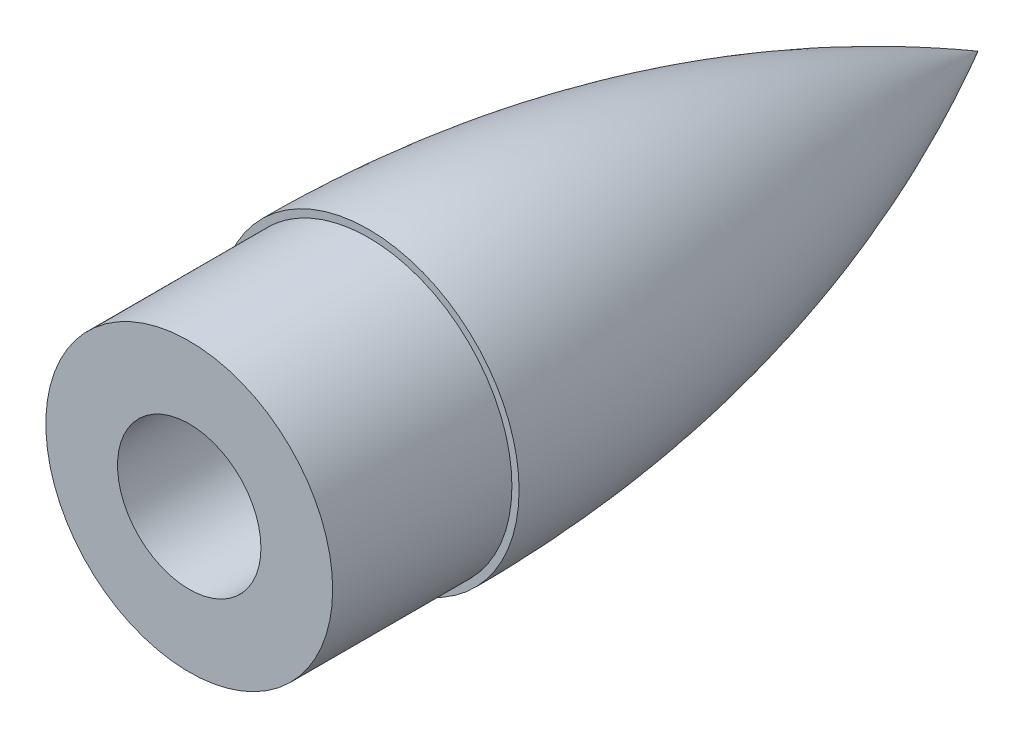
ISO-10303-21;
HEADER;
FILE_DESCRIPTION(('STEP AP214'),'2;1');
FILE_NAME('part.step','',(''),(''),'','','');
FILE_SCHEMA(('AUTOMOTIVE_DESIGN { 1 0 10303 214 1 1 1 1 }'));
ENDSEC;
DATA;
#1=APPLICATION_CONTEXT('core data for automotive mechanical design processes');
#2=APPLICATION_PROTOCOL_DEFINITION('international standard','automotive_design',2000,#1);
#3=PRODUCT_CONTEXT('',#1,'mechanical');
#4=PRODUCT('Part','Part','',(#3));
#5=PRODUCT_RELATED_PRODUCT_CATEGORY('part','',(#4));
#6=PRODUCT_DEFINITION_FORMATION('','',#4);
#7=PRODUCT_DEFINITION_CONTEXT('part definition',#1,'design');
#8=PRODUCT_DEFINITION('design','',#6,#7);
#9=PRODUCT_DEFINITION_SHAPE('','',#8);
#10=(LENGTH_UNIT() NAMED_UNIT(*) SI_UNIT(.MILLI.,.METRE.));
#11=(NAMED_UNIT(*) PLANE_ANGLE_UNIT() SI_UNIT($,.RADIAN.));
#12=(NAMED_UNIT(*) SI_UNIT($,.STERADIAN.) SOLID_ANGLE_UNIT());
#13=UNCERTAINTY_MEASURE_WITH_UNIT(LENGTH_MEASURE(1.E-05),#10,'distance_accuracy_value','');
#14=(GEOMETRIC_REPRESENTATION_CONTEXT(3) GLOBAL_UNCERTAINTY_ASSIGNED_CONTEXT((#13)) GLOBAL_UNIT_ASSIGNED_CONTEXT((#10,
#11,#12)) REPRESENTATION_CONTEXT('',''));
#15=CARTESIAN_POINT('',(0.,0.,0.));
#16=DIRECTION('',(0.,0.,1.));
#17=DIRECTION('',(1.,0.,0.));
#18=AXIS2_PLACEMENT_3D('',#15,#16,#17);
#19=CARTESIAN_POINT('',(0.,0.,50.));
#20=DIRECTION('',(0.,0.,-1.));
#21=DIRECTION('',(-1.,0.,0.));
#22=AXIS2_PLACEMENT_3D('',#19,#20,#21);
#23=CYLINDRICAL_SURFACE('',#22,40.);
#24=CARTESIAN_POINT('',(0.,0.,50.));
#25=DIRECTION('',(0.,0.,1.));
#26=DIRECTION('',(1.,0.,0.));
#27=AXIS2_PLACEMENT_3D('',#24,#25,#26);
#28=CIRCLE('',#27,40.);
#29=CARTESIAN_POINT('',(40.,0.,50.));
#30=VERTEX_POINT('',#29);
#31=EDGE_CURVE('E12',#30,#30,#28,.T.);
#32=ORIENTED_EDGE('',*,*,#31,.F.);
#33=EDGE_LOOP('',(#32));
#34=FACE_BOUND('',#33,.T.);
#35=CARTESIAN_POINT('',(0.,0.,0.));
#36=DIRECTION('',(0.,0.,1.));
#37=DIRECTION('',(1.,0.,0.));
#38=AXIS2_PLACEMENT_3D('',#35,#36,#37);
#39=CIRCLE('',#38,40.);
#40=CARTESIAN_POINT('',(40.,0.,0.));
#41=VERTEX_POINT('',#40);
#42=EDGE_CURVE('E58',#41,#41,#39,.T.);
#43=ORIENTED_EDGE('',*,*,#42,.T.);
#44=EDGE_LOOP('',(#43));
#45=FACE_BOUND('',#44,.T.);
#46=ADVANCED_FACE('F51',(#34,#45),#23,.T.);
#47=CARTESIAN_POINT('',(0.,0.,50.));
#48=DIRECTION('',(0.,0.,1.));
#49=DIRECTION('',(1.,0.,0.));
#50=AXIS2_PLACEMENT_3D('',#47,#48,#49);
#51=PLANE('',#50);
#52=CARTESIAN_POINT('',(0.,0.,50.));
#53=DIRECTION('',(0.,0.,1.));
#54=DIRECTION('',(1.,0.,0.));
#55=AXIS2_PLACEMENT_3D('',#52,#53,#54);
#56=CIRCLE('',#55,20.);
#57=CARTESIAN_POINT('',(20.,0.,50.));
#58=VERTEX_POINT('',#57);
#59=EDGE_CURVE('E64',#58,#58,#56,.T.);
#60=ORIENTED_EDGE('',*,*,#59,.F.);
#61=EDGE_LOOP('',(#60));
#62=FACE_BOUND('',#61,.T.);
#63=ORIENTED_EDGE('',*,*,#31,.T.);
#64=EDGE_LOOP('',(#63));
#65=FACE_BOUND('',#64,.T.);
#66=ADVANCED_FACE('F80',(#62,#65),#51,.T.);
#67=CARTESIAN_POINT('',(0.,0.,0.));
#68=DIRECTION('',(0.,0.,1.));
#69=DIRECTION('',(1.,0.,0.));
#70=AXIS2_PLACEMENT_3D('',#67,#68,#69);
#71=PLANE('',#70);
#72=CARTESIAN_POINT('',(0.,0.,0.));
#73=DIRECTION('',(0.,0.,1.));
#74=DIRECTION('',(1.,0.,0.));
#75=AXIS2_PLACEMENT_3D('',#72,#73,#74);
#76=CIRCLE('',#75,20.);
#77=CARTESIAN_POINT('',(20.,0.,0.));
#78=VERTEX_POINT('',#77);
#79=EDGE_CURVE('E54',#78,#78,#76,.T.);
#80=ORIENTED_EDGE('',*,*,#79,.T.);
#81=EDGE_LOOP('',(#80));
#82=FACE_BOUND('',#81,.T.);
#83=ORIENTED_EDGE('',*,*,#42,.F.);
#84=EDGE_LOOP('',(#83));
#85=FACE_BOUND('',#84,.T.);
#86=ADVANCED_FACE('F71',(#82,#85),#71,.F.);
#87=CARTESIAN_POINT('',(0.,0.,-86.5685424949261));
#88=DIRECTION('',(0.,0.,1.));
#89=DIRECTION('',(1.,0.,0.));
#90=AXIS2_PLACEMENT_3D('',#87,#88,#89);
#91=CYLINDRICAL_SURFACE('',#90,20.);
#92=ORIENTED_EDGE('',*,*,#59,.T.);
#93=EDGE_LOOP('',(#92));
#94=FACE_BOUND('',#93,.T.);
#95=ORIENTED_EDGE('',*,*,#79,.F.);
#96=EDGE_LOOP('',(#95));
#97=FACE_BOUND('',#96,.T.);
#98=ADVANCED_FACE('F74',(#94,#97),#91,.F.);
#99=CLOSED_SHELL('',(#46,#66,#86,#98));
#100=MANIFOLD_SOLID_BREP('B2',#99);
#101=CARTESIAN_POINT('',(0.,-952480.330579064,305556.828932321));
#102=CARTESIAN_POINT('',(0.,943797.331683316,-330703.529497843));
#103=CARTESIAN_POINT('',(0.,-935034.950646506,355361.679487625));
#104=B_SPLINE_CURVE_WITH_KNOTS('',2,(#101,#102,#103),.UNSPECIFIED.,.F.,.F.,(3,3),(0.,1.),.UNSPECIFIED.);
#105=CARTESIAN_POINT('',(0.,0.,-30.));
#106=DIRECTION('',(0.,0.,-1.));
#107=AXIS1_PLACEMENT('',#105,#106);
#108=SURFACE_OF_REVOLUTION('',#104,#107);
#109=CARTESIAN_POINT('',(0.,0.,0.));
#110=DIRECTION('',(0.,0.,-1.));
#111=DIRECTION('',(0.,1.,0.));
#112=AXIS2_PLACEMENT_3D('',#109,#110,#111);
#113=CIRCLE('',#112,40.);
#114=CARTESIAN_POINT('',(0.,40.,0.));
#115=VERTEX_POINT('',#114);
#116=EDGE_CURVE('E50',#115,#115,#113,.T.);
#117=ORIENTED_EDGE('',*,*,#116,.T.);
#118=EDGE_LOOP('',(#117));
#119=FACE_BOUND('',#118,.T.);
#120=CARTESIAN_POINT('',(0.,0.,-30.0000000000047));
#121=DIRECTION('',(0.,0.,-1.));
#122=DIRECTION('',(0.,1.,0.));
#123=AXIS2_PLACEMENT_3D('',#120,#121,#122);
#124=CIRCLE('',#123,38.8848228887964);
#125=CARTESIAN_POINT('',(0.,38.8848228887964,-30.0000000000047));
#126=VERTEX_POINT('',#125);
#127=EDGE_CURVE('E130',#126,#126,#124,.T.);
#128=ORIENTED_EDGE('',*,*,#127,.F.);
#129=EDGE_LOOP('',(#128));
#130=FACE_BOUND('',#129,.T.);
#131=ADVANCED_FACE('F123',(#119,#130),#108,.F.);
#132=CARTESIAN_POINT('',(0.,0.,0.));
#133=DIRECTION('',(0.,0.,1.));
#134=DIRECTION('',(0.,-1.,0.));
#135=AXIS2_PLACEMENT_3D('',#132,#133,#134);
#136=PLANE('',#135);
#137=CARTESIAN_POINT('',(0.,0.,0.));
#138=DIRECTION('',(0.,0.,1.));
#139=DIRECTION('',(0.,-1.,0.));
#140=AXIS2_PLACEMENT_3D('',#137,#138,#139);
#141=CIRCLE('',#140,20.);
#142=CARTESIAN_POINT('',(0.,-20.,0.));
#143=VERTEX_POINT('',#142);
#144=EDGE_CURVE('E134',#143,#143,#141,.T.);
#145=ORIENTED_EDGE('',*,*,#144,.F.);
#146=EDGE_LOOP('',(#145));
#147=FACE_BOUND('',#146,.T.);
#148=ORIENTED_EDGE('',*,*,#116,.F.);
#149=EDGE_LOOP('',(#148));
#150=FACE_BOUND('',#149,.T.);
#151=ADVANCED_FACE('F159',(#147,#150),#136,.T.);
#152=CARTESIAN_POINT('',(0.,0.,-30.0000000000023));
#153=DIRECTION('',(0.,0.,-1.));
#154=DIRECTION('',(0.,1.,0.));
#155=AXIS2_PLACEMENT_3D('',#152,#153,#154);
#156=PLANE('',#155);
#157=CARTESIAN_POINT('',(0.,0.,-30.0000000000023));
#158=DIRECTION('',(0.,0.,-1.));
#159=DIRECTION('',(0.,1.,0.));
#160=AXIS2_PLACEMENT_3D('',#157,#158,#159);
#161=CIRCLE('',#160,20.);
#162=CARTESIAN_POINT('',(0.,20.,-30.0000000000023));
#163=VERTEX_POINT('',#162);
#164=EDGE_CURVE('E138',#163,#163,#161,.F.);
#165=ORIENTED_EDGE('',*,*,#164,.T.);
#166=EDGE_LOOP('',(#165));
#167=FACE_BOUND('',#166,.T.);
#168=ORIENTED_EDGE('',*,*,#127,.T.);
#169=EDGE_LOOP('',(#168));
#170=FACE_BOUND('',#169,.T.);
#171=ADVANCED_FACE('F150',(#167,#170),#156,.T.);
#172=CARTESIAN_POINT('',(0.,0.,-86.5685424949261));
#173=DIRECTION('',(0.,0.,1.));
#174=DIRECTION('',(1.,0.,0.));
#175=AXIS2_PLACEMENT_3D('',#172,#173,#174);
#176=CYLINDRICAL_SURFACE('',#175,20.);
#177=ORIENTED_EDGE('',*,*,#144,.T.);
#178=EDGE_LOOP('',(#177));
#179=FACE_BOUND('',#178,.T.);
#180=ORIENTED_EDGE('',*,*,#164,.F.);
#181=EDGE_LOOP('',(#180));
#182=FACE_BOUND('',#181,.T.);
#183=ADVANCED_FACE('F152',(#179,#182),#176,.F.);
#184=CLOSED_SHELL('',(#131,#151,#171,#183));
#185=MANIFOLD_SOLID_BREP('B7',#184);
#186=CARTESIAN_POINT('',(0.,0.,-75.));
#187=DIRECTION('',(0.,0.,1.));
#188=DIRECTION('',(1.,0.,0.));
#189=AXIS2_PLACEMENT_3D('',#186,#187,#188);
#190=PLANE('',#189);
#191=CARTESIAN_POINT('',(8.00000000000001,18.,-75.));
#192=DIRECTION('',(0.,0.,1.));
#193=DIRECTION('',(1.,0.,0.));
#194=AXIS2_PLACEMENT_3D('',#191,#192,#193);
#195=CIRCLE('',#194,1.5);
#196=CARTESIAN_POINT('',(9.50000000000001,18.,-75.));
#197=VERTEX_POINT('',#196);
#198=EDGE_CURVE('E433',#197,#197,#195,.T.);
#199=ORIENTED_EDGE('',*,*,#198,.F.);
#200=EDGE_LOOP('',(#199));
#201=FACE_BOUND('',#200,.T.);
#202=CARTESIAN_POINT('',(-8.00000000000001,18.,-75.));
#203=DIRECTION('',(0.,0.,1.));
#204=DIRECTION('',(1.,0.,0.));
#205=AXIS2_PLACEMENT_3D('',#202,#203,#204);
#206=CIRCLE('',#205,1.5);
#207=CARTESIAN_POINT('',(-6.50000000000001,18.,-75.));
#208=VERTEX_POINT('',#207);
#209=EDGE_CURVE('E421',#208,#208,#206,.T.);
#210=ORIENTED_EDGE('',*,*,#209,.F.);
#211=EDGE_LOOP('',(#210));
#212=FACE_BOUND('',#211,.T.);
#213=DIRECTION('',(0.,1.,0.));
#214=VECTOR('',#213,1.);
#215=CARTESIAN_POINT('',(9.99999999999999,24.,-75.));
#216=LINE('',#215,#214);
#217=CARTESIAN_POINT('',(9.99999999999999,12.,-75.));
#218=VERTEX_POINT('',#217);
#219=CARTESIAN_POINT('',(9.99999999999999,24.,-75.));
#220=VERTEX_POINT('',#219);
#221=EDGE_CURVE('E375',#218,#220,#216,.T.);
#222=ORIENTED_EDGE('',*,*,#221,.T.);
#223=DIRECTION('',(-1.,0.,0.));
#224=VECTOR('',#223,1.);
#225=CARTESIAN_POINT('',(-10.,24.,-75.));
#226=LINE('',#225,#224);
#227=CARTESIAN_POINT('',(-10.,24.,-75.));
#228=VERTEX_POINT('',#227);
#229=EDGE_CURVE('E388',#220,#228,#226,.T.);
#230=ORIENTED_EDGE('',*,*,#229,.T.);
#231=DIRECTION('',(0.,-1.,0.));
#232=VECTOR('',#231,1.);
#233=CARTESIAN_POINT('',(-10.,24.,-75.));
#234=LINE('',#233,#232);
#235=CARTESIAN_POINT('',(-10.,12.,-75.));
#236=VERTEX_POINT('',#235);
#237=EDGE_CURVE('E386',#228,#236,#234,.T.);
#238=ORIENTED_EDGE('',*,*,#237,.T.);
#239=DIRECTION('',(1.,0.,0.));
#240=VECTOR('',#239,1.);
#241=CARTESIAN_POINT('',(-10.,12.,-75.));
#242=LINE('',#241,#240);
#243=EDGE_CURVE('E372',#236,#218,#242,.T.);
#244=ORIENTED_EDGE('',*,*,#243,.T.);
#245=EDGE_LOOP('',(#222,#230,#238,#244));
#246=FACE_BOUND('',#245,.T.);
#247=CARTESIAN_POINT('',(-3.16059916166108,14.0729214034223,-75.));
#248=CARTESIAN_POINT('',(-2.94583485791234,13.8946913830768,-75.));
#249=CARTESIAN_POINT('',(-2.71608729397581,13.7342308670995,-75.));
#250=CARTESIAN_POINT('',(-2.23282532739842,13.4538457852336,-75.));
#251=CARTESIAN_POINT('',(-1.97928754750219,13.3339616355961,-75.));
#252=CARTESIAN_POINT('',(-1.45551397809345,13.1386458609719,-75.));
#253=CARTESIAN_POINT('',(-1.18527406340008,13.063225266693,-75.));
#254=CARTESIAN_POINT('',(-0.635969603154624,12.9594203677996,-75.));
#255=CARTESIAN_POINT('',(-0.356907423324288,12.9310235608046,-75.));
#256=CARTESIAN_POINT('',(0.19895991286752,12.9222319208422,-75.));
#257=CARTESIAN_POINT('',(0.475757064172734,12.9413241085915,-75.));
#258=CARTESIAN_POINT('',(1.02219234275111,13.0257985339755,-75.));
#259=CARTESIAN_POINT('',(1.29183033499267,13.0911816440782,-75.));
#260=CARTESIAN_POINT('',(1.81596404480132,13.2659729499768,-75.));
#261=CARTESIAN_POINT('',(2.07048188892984,13.3753148998359,-75.));
#262=CARTESIAN_POINT('',(2.55790343375491,13.6346081053641,-75.));
#263=CARTESIAN_POINT('',(2.79080575462244,13.7845619511067,-75.));
#264=CARTESIAN_POINT('',(3.23189079860799,14.1229538010927,-75.));
#265=CARTESIAN_POINT('',(3.43968695182899,14.3118955259936,-75.));
#266=CARTESIAN_POINT('',(3.82128824201915,14.7214462656352,-75.));
#267=CARTESIAN_POINT('',(3.99509032872879,14.9420581190337,-75.));
#268=CARTESIAN_POINT('',(4.30688209228289,15.412848005206,-75.));
#269=CARTESIAN_POINT('',(4.44419641158855,15.6634734885421,-75.));
#270=CARTESIAN_POINT('',(4.67527968923303,16.1840580082506,-75.));
#271=CARTESIAN_POINT('',(4.76904598762183,16.4540182244429,-75.));
#272=CARTESIAN_POINT('',(4.91115126364408,17.008481347682,-75.));
#273=CARTESIAN_POINT('',(4.95903532618206,17.2931009873812,-75.));
#274=CARTESIAN_POINT('',(5.00633681550658,17.8663455167293,-75.));
#275=CARTESIAN_POINT('',(5.00575381600016,18.1549704415844,-75.));
#276=CARTESIAN_POINT('',(4.9559941978138,18.7279511017093,-75.));
#277=CARTESIAN_POINT('',(4.90682755612147,19.0123077013378,-75.));
#278=CARTESIAN_POINT('',(4.76113006191656,19.5686222335078,-75.));
#279=CARTESIAN_POINT('',(4.66460058334928,19.8405805254609,-75.));
#280=CARTESIAN_POINT('',(4.42755776788495,20.3624296940068,-75.));
#281=CARTESIAN_POINT('',(4.28734009932476,20.6124548465269,-75.));
#282=CARTESIAN_POINT('',(3.96657519374881,21.0851422767806,-75.));
#283=CARTESIAN_POINT('',(3.78602974419901,21.3078057665994,-75.));
#284=CARTESIAN_POINT('',(3.39139438893593,21.7174316246317,-75.));
#285=CARTESIAN_POINT('',(3.17760375168565,21.904682320128,-75.));
#286=CARTESIAN_POINT('',(2.72142090278319,22.2403118199993,-75.));
#287=CARTESIAN_POINT('',(2.47902988177984,22.3886922417365,-75.));
#288=CARTESIAN_POINT('',(1.9744617089508,22.6412457117157,-75.));
#289=CARTESIAN_POINT('',(1.71244381249318,22.7457369865449,-75.));
#290=CARTESIAN_POINT('',(1.17453465746497,22.9090122400562,-75.));
#291=CARTESIAN_POINT('',(0.898643810686573,22.9677975745807,-75.));
#292=CARTESIAN_POINT('',(0.342211094342769,23.0377614058332,-75.));
#293=CARTESIAN_POINT('',(0.061697153587046,23.049162190958,-75.));
#294=CARTESIAN_POINT('',(-0.49725142611449,23.0246342813923,-75.));
#295=CARTESIAN_POINT('',(-0.775686092291113,22.9887062076318,-75.));
#296=CARTESIAN_POINT('',(-1.32217177165447,22.8706581159743,-75.));
#297=CARTESIAN_POINT('',(-1.59023677840639,22.7886028477402,-75.));
#298=CARTESIAN_POINT('',(-2.10882504056591,22.5807402511957,-75.));
#299=CARTESIAN_POINT('',(-2.35934824851062,22.4549328045104,-75.));
#300=CARTESIAN_POINT('',(-2.83631496723476,22.1629168996046,-75.));
#301=CARTESIAN_POINT('',(-3.06270889448407,21.9966274713925,-75.));
#302=CARTESIAN_POINT('',(-3.48454532281931,21.6285811229784,-75.));
#303=CARTESIAN_POINT('',(-3.67998713443426,21.4268234129171,-75.));
#304=CARTESIAN_POINT('',(-4.03549481934509,20.9924762428376,-75.));
#305=CARTESIAN_POINT('',(-4.19537135626086,20.7597318389335,-75.));
#306=CARTESIAN_POINT('',(-4.47412320156357,20.2708691210318,-75.));
#307=CARTESIAN_POINT('',(-4.59299694072873,20.0147499129292,-75.));
#308=CARTESIAN_POINT('',(-4.78736098659507,19.4843165363145,-75.));
#309=CARTESIAN_POINT('',(-4.86251130082955,19.2098778013106,-75.));
#310=CARTESIAN_POINT('',(-4.96609115055086,18.6523338035853,-75.));
#311=CARTESIAN_POINT('',(-4.99452030522474,18.3692284702437,-75.));
#312=CARTESIAN_POINT('',(-5.00408019381873,17.7998594213194,-75.));
#313=CARTESIAN_POINT('',(-4.98481473207851,17.5135890481954,-75.));
#314=CARTESIAN_POINT('',(-4.89879299150568,16.9481930612561,-75.));
#315=CARTESIAN_POINT('',(-4.83202306039183,16.6690695252619,-75.));
#316=CARTESIAN_POINT('',(-4.65231550884784,16.1241069888341,-75.));
#317=CARTESIAN_POINT('',(-4.53908064995093,15.8583661194697,-75.));
#318=CARTESIAN_POINT('',(-4.26962699450263,15.3499138413232,-75.));
#319=CARTESIAN_POINT('',(-4.11345778623225,15.1071762964751,-75.));
#320=CARTESIAN_POINT('',(-3.82386915326151,14.7312190664411,-75.));
#321=CARTESIAN_POINT('',(-3.70151879195332,14.5893344167634,-75.));
#322=CARTESIAN_POINT('',(-3.44189116474378,14.319943529603,-75.));
#323=CARTESIAN_POINT('',(-3.30461389127373,14.1924372994109,-75.));
#324=CARTESIAN_POINT('',(-3.16059916166108,14.0729214034223,-75.));
#325=B_SPLINE_CURVE_WITH_KNOTS('',3,(#247,#248,#249,#250,#251,#252,#253,#254,#255,#256,#257,
#258,#259,#260,#261,#262,#263,#264,#265,#266,#267,#268,#269,#270,#271,#272,#273,#274,#275,#276,
#277,#278,#279,#280,#281,#282,#283,#284,#285,#286,#287,#288,#289,#290,#291,#292,#293,#294,#295,
#296,#297,#298,#299,#300,#301,#302,#303,#304,#305,#306,#307,#308,#309,#310,#311,#312,#313,#314,
#315,#316,#317,#318,#319,#320,#321,#322,#323,#324),.UNSPECIFIED.,.T.,.F.,(4,2,2,2,2,2,2,2,2,2,2,
2,2,2,2,2,2,2,2,2,2,2,2,2,2,2,2,2,2,2,2,2,2,2,2,2,2,2,4),(0.,0.836594176239652,1.6740192098953,
2.51165190818621,3.34906186633622,4.177465432464,5.00588461233971,5.83306001702642,
6.66028818826886,7.49896093053545,8.3377088917263,9.19104307826718,10.0444293803308,
10.9061919043506,11.7679620080196,12.6295551779964,13.4911233555534,14.3469829104066,
15.2028045381459,16.0513260634238,16.8998122767649,17.7420354982567,18.5842337346916,
19.4224765957388,20.260708459583,21.0977666082912,21.934827021742,22.773575638591,
23.6123429362795,24.4554739932933,25.2986373142728,26.1482723294763,26.9979142698167,
27.8546377674064,28.7116075777605,29.5741471151888,30.4356945925373,30.9966901625315,
31.5576860169805),.UNSPECIFIED.);
#326=CARTESIAN_POINT('',(-5.,18.0000000000002,-75.));
#327=VERTEX_POINT('',#326);
#328=CARTESIAN_POINT('',(5.,18.0000000000002,-75.));
#329=VERTEX_POINT('',#328);
#330=EDGE_CURVE('E206',#327,#329,#325,.T.);
#331=ORIENTED_EDGE('',*,*,#330,.F.);
#332=DIRECTION('',(1.,0.,0.));
#333=VECTOR('',#332,1.);
#334=CARTESIAN_POINT('',(0.,18.0000000000002,-75.));
#335=LINE('',#334,#333);
#336=EDGE_CURVE('E121',#327,#329,#335,.T.);
#337=ORIENTED_EDGE('',*,*,#336,.T.);
#338=EDGE_LOOP('',(#331,#337));
#339=FACE_BOUND('',#338,.T.);
#340=ADVANCED_FACE('F193',(#201,#212,#246,#339),#190,.T.);
#341=CARTESIAN_POINT('',(0.,30.586298473716,-85.));
#342=DIRECTION('',(0.,0.,1.));
#343=DIRECTION('',(0.,-1.,0.));
#344=AXIS2_PLACEMENT_3D('',#341,#342,#343);
#345=PLANE('',#344);
#346=CARTESIAN_POINT('',(0.,0.,-85.));
#347=DIRECTION('',(0.,0.,-1.));
#348=DIRECTION('',(0.,1.,0.));
#349=AXIS2_PLACEMENT_3D('',#346,#347,#348);
#350=CIRCLE('',#349,30.586298473716);
#351=CARTESIAN_POINT('',(0.,30.586298473716,-85.));
#352=VERTEX_POINT('',#351);
#353=EDGE_CURVE('E354',#352,#352,#350,.T.);
#354=ORIENTED_EDGE('',*,*,#353,.F.);
#355=EDGE_LOOP('',(#354));
#356=FACE_BOUND('',#355,.T.);
#357=DIRECTION('',(-1.,0.,0.));
#358=VECTOR('',#357,1.);
#359=CARTESIAN_POINT('',(-10.,24.,-85.));
#360=LINE('',#359,#358);
#361=CARTESIAN_POINT('',(9.99999999999999,24.,-85.));
#362=VERTEX_POINT('',#361);
#363=CARTESIAN_POINT('',(-10.,24.,-85.));
#364=VERTEX_POINT('',#363);
#365=EDGE_CURVE('E379',#362,#364,#360,.T.);
#366=ORIENTED_EDGE('',*,*,#365,.F.);
#367=DIRECTION('',(0.,1.,0.));
#368=VECTOR('',#367,1.);
#369=CARTESIAN_POINT('',(9.99999999999999,24.,-85.));
#370=LINE('',#369,#368);
#371=CARTESIAN_POINT('',(9.99999999999999,12.,-85.));
#372=VERTEX_POINT('',#371);
#373=EDGE_CURVE('E381',#372,#362,#370,.T.);
#374=ORIENTED_EDGE('',*,*,#373,.F.);
#375=DIRECTION('',(1.,0.,0.));
#376=VECTOR('',#375,1.);
#377=CARTESIAN_POINT('',(-10.,12.,-85.));
#378=LINE('',#377,#376);
#379=CARTESIAN_POINT('',(-10.,12.,-85.));
#380=VERTEX_POINT('',#379);
#381=EDGE_CURVE('E373',#380,#372,#378,.T.);
#382=ORIENTED_EDGE('',*,*,#381,.F.);
#383=DIRECTION('',(0.,-1.,0.));
#384=VECTOR('',#383,1.);
#385=CARTESIAN_POINT('',(-10.,24.,-85.));
#386=LINE('',#385,#384);
#387=EDGE_CURVE('E376',#364,#380,#386,.T.);
#388=ORIENTED_EDGE('',*,*,#387,.F.);
#389=EDGE_LOOP('',(#366,#374,#382,#388));
#390=FACE_BOUND('',#389,.T.);
#391=DIRECTION('',(1.,0.,0.));
#392=VECTOR('',#391,1.);
#393=CARTESIAN_POINT('',(-10.,-24.,-85.));
#394=LINE('',#393,#392);
#395=CARTESIAN_POINT('',(-10.,-24.,-85.));
#396=VERTEX_POINT('',#395);
#397=CARTESIAN_POINT('',(9.99999999999999,-24.,-85.));
#398=VERTEX_POINT('',#397);
#399=EDGE_CURVE('E408',#396,#398,#394,.T.);
#400=ORIENTED_EDGE('',*,*,#399,.F.);
#401=DIRECTION('',(0.,-1.,0.));
#402=VECTOR('',#401,1.);
#403=CARTESIAN_POINT('',(-10.,-24.,-85.));
#404=LINE('',#403,#402);
#405=CARTESIAN_POINT('',(-10.,-12.,-85.));
#406=VERTEX_POINT('',#405);
#407=EDGE_CURVE('E410',#406,#396,#404,.T.);
#408=ORIENTED_EDGE('',*,*,#407,.F.);
#409=DIRECTION('',(-1.,0.,0.));
#410=VECTOR('',#409,1.);
#411=CARTESIAN_POINT('',(-10.,-12.,-85.));
#412=LINE('',#411,#410);
#413=CARTESIAN_POINT('',(9.99999999999999,-12.,-85.));
#414=VERTEX_POINT('',#413);
#415=EDGE_CURVE('E402',#414,#406,#412,.T.);
#416=ORIENTED_EDGE('',*,*,#415,.F.);
#417=DIRECTION('',(0.,1.,0.));
#418=VECTOR('',#417,1.);
#419=CARTESIAN_POINT('',(9.99999999999999,-24.,-85.));
#420=LINE('',#419,#418);
#421=EDGE_CURVE('E405',#398,#414,#420,.T.);
#422=ORIENTED_EDGE('',*,*,#421,.F.);
#423=EDGE_LOOP('',(#400,#408,#416,#422));
#424=FACE_BOUND('',#423,.T.);
#425=ADVANCED_FACE('F313',(#356,#390,#424),#345,.T.);
#426=CARTESIAN_POINT('',(0.,0.,-2.10884178813174E-13));
#427=DIRECTION('',(0.,0.,1.));
#428=DIRECTION('',(1.,0.,0.));
#429=AXIS2_PLACEMENT_3D('',#426,#427,#428);
#430=PLANE('',#429);
#431=CARTESIAN_POINT('',(0.,0.,-2.22044604925031E-13));
#432=DIRECTION('',(0.,0.,1.));
#433=DIRECTION('',(1.,0.,0.));
#434=AXIS2_PLACEMENT_3D('',#431,#432,#433);
#435=CIRCLE('',#434,42.);
#436=CARTESIAN_POINT('',(42.,0.,-2.22044604925031E-13));
#437=VERTEX_POINT('',#436);
#438=EDGE_CURVE('E349',#437,#437,#435,.T.);
#439=ORIENTED_EDGE('',*,*,#438,.T.);
#440=EDGE_LOOP('',(#439));
#441=FACE_BOUND('',#440,.T.);
#442=CARTESIAN_POINT('',(0.,0.,-1.94289029309402E-13));
#443=DIRECTION('',(0.,0.,1.));
#444=DIRECTION('',(1.,0.,0.));
#445=AXIS2_PLACEMENT_3D('',#442,#443,#444);
#446=CIRCLE('',#445,40.);
#447=CARTESIAN_POINT('',(40.,0.,-1.94289029309402E-13));
#448=VERTEX_POINT('',#447);
#449=EDGE_CURVE('E274',#448,#448,#446,.T.);
#450=ORIENTED_EDGE('',*,*,#449,.F.);
#451=EDGE_LOOP('',(#450));
#452=FACE_BOUND('',#451,.T.);
#453=ADVANCED_FACE('F195',(#441,#452),#430,.T.);
#454=CARTESIAN_POINT('',(0.,40.,0.));
#455=CARTESIAN_POINT('',(0.,40.,-91.0054943396276));
#456=CARTESIAN_POINT('',(0.,0.,-168.));
#457=B_SPLINE_CURVE_WITH_KNOTS('',2,(#454,#455,#456),.UNSPECIFIED.,.F.,.F.,(3,3),(0.,1.),.UNSPECIFIED.);
#458=CARTESIAN_POINT('',(0.,0.,168.));
#459=DIRECTION('',(0.,0.,1.));
#460=AXIS1_PLACEMENT('',#458,#459);
#461=SURFACE_OF_REVOLUTION('',#457,#460);
#462=ORIENTED_EDGE('',*,*,#353,.T.);
#463=EDGE_LOOP('',(#462));
#464=FACE_BOUND('',#463,.T.);
#465=ORIENTED_EDGE('',*,*,#449,.T.);
#466=EDGE_LOOP('',(#465));
#467=FACE_BOUND('',#466,.T.);
#468=ADVANCED_FACE('F339',(#464,#467),#461,.T.);
#469=CARTESIAN_POINT('',(0.,42.,0.));
#470=CARTESIAN_POINT('',(0.,42.,-92.1954445729289));
#471=CARTESIAN_POINT('',(0.,0.,-170.));
#472=B_SPLINE_CURVE_WITH_KNOTS('',2,(#469,#470,#471),.UNSPECIFIED.,.F.,.F.,(3,3),(0.,1.),.UNSPECIFIED.);
#473=CARTESIAN_POINT('',(0.,0.,168.));
#474=DIRECTION('',(0.,0.,1.));
#475=AXIS1_PLACEMENT('',#473,#474);
#476=SURFACE_OF_REVOLUTION('',#472,#475);
#477=CARTESIAN_POINT('',(0.,0.,-170.));
#478=VERTEX_POINT('',#477);
#479=VERTEX_LOOP('',#478);
#480=FACE_BOUND('',#479,.T.);
#481=ORIENTED_EDGE('',*,*,#438,.F.);
#482=EDGE_LOOP('',(#481));
#483=FACE_BOUND('',#482,.T.);
#484=ADVANCED_FACE('F332',(#480,#483),#476,.F.);
#485=CARTESIAN_POINT('',(9.99999999999999,24.,-75.));
#486=DIRECTION('',(-1.,0.,0.));
#487=DIRECTION('',(0.,-1.,0.));
#488=AXIS2_PLACEMENT_3D('',#485,#486,#487);
#489=PLANE('',#488);
#490=ORIENTED_EDGE('',*,*,#373,.T.);
#491=DIRECTION('',(0.,0.,-1.));
#492=VECTOR('',#491,1.);
#493=CARTESIAN_POINT('',(9.99999999999999,24.,-75.));
#494=LINE('',#493,#492);
#495=EDGE_CURVE('E359',#220,#362,#494,.T.);
#496=ORIENTED_EDGE('',*,*,#495,.F.);
#497=ORIENTED_EDGE('',*,*,#221,.F.);
#498=DIRECTION('',(0.,0.,-1.));
#499=VECTOR('',#498,1.);
#500=CARTESIAN_POINT('',(9.99999999999999,12.,-75.));
#501=LINE('',#500,#499);
#502=EDGE_CURVE('E369',#218,#372,#501,.T.);
#503=ORIENTED_EDGE('',*,*,#502,.T.);
#504=EDGE_LOOP('',(#490,#496,#497,#503));
#505=FACE_BOUND('',#504,.T.);
#506=ADVANCED_FACE('F328',(#505),#489,.F.);
#507=CARTESIAN_POINT('',(-10.,24.,-75.));
#508=DIRECTION('',(0.,-1.,0.));
#509=DIRECTION('',(1.,0.,0.));
#510=AXIS2_PLACEMENT_3D('',#507,#508,#509);
#511=PLANE('',#510);
#512=ORIENTED_EDGE('',*,*,#365,.T.);
#513=DIRECTION('',(0.,0.,-1.));
#514=VECTOR('',#513,1.);
#515=CARTESIAN_POINT('',(-10.,24.,-75.));
#516=LINE('',#515,#514);
#517=EDGE_CURVE('E362',#228,#364,#516,.T.);
#518=ORIENTED_EDGE('',*,*,#517,.F.);
#519=ORIENTED_EDGE('',*,*,#229,.F.);
#520=ORIENTED_EDGE('',*,*,#495,.T.);
#521=EDGE_LOOP('',(#512,#518,#519,#520));
#522=FACE_BOUND('',#521,.T.);
#523=ADVANCED_FACE('F324',(#522),#511,.F.);
#524=CARTESIAN_POINT('',(-10.,24.,-75.));
#525=DIRECTION('',(1.,0.,0.));
#526=DIRECTION('',(0.,0.,-1.));
#527=AXIS2_PLACEMENT_3D('',#524,#525,#526);
#528=PLANE('',#527);
#529=ORIENTED_EDGE('',*,*,#387,.T.);
#530=DIRECTION('',(0.,0.,-1.));
#531=VECTOR('',#530,1.);
#532=CARTESIAN_POINT('',(-10.,12.,-75.));
#533=LINE('',#532,#531);
#534=EDGE_CURVE('E367',#236,#380,#533,.T.);
#535=ORIENTED_EDGE('',*,*,#534,.F.);
#536=ORIENTED_EDGE('',*,*,#237,.F.);
#537=ORIENTED_EDGE('',*,*,#517,.T.);
#538=EDGE_LOOP('',(#529,#535,#536,#537));
#539=FACE_BOUND('',#538,.T.);
#540=ADVANCED_FACE('F320',(#539),#528,.F.);
#541=CARTESIAN_POINT('',(-10.,12.,-75.));
#542=DIRECTION('',(0.,1.,0.));
#543=DIRECTION('',(-1.,0.,0.));
#544=AXIS2_PLACEMENT_3D('',#541,#542,#543);
#545=PLANE('',#544);
#546=ORIENTED_EDGE('',*,*,#381,.T.);
#547=ORIENTED_EDGE('',*,*,#502,.F.);
#548=ORIENTED_EDGE('',*,*,#243,.F.);
#549=ORIENTED_EDGE('',*,*,#534,.T.);
#550=EDGE_LOOP('',(#546,#547,#548,#549));
#551=FACE_BOUND('',#550,.T.);
#552=ADVANCED_FACE('F317',(#551),#545,.F.);
#553=CARTESIAN_POINT('',(-10.,-24.,-75.));
#554=DIRECTION('',(1.,0.,0.));
#555=DIRECTION('',(0.,0.,-1.));
#556=AXIS2_PLACEMENT_3D('',#553,#554,#555);
#557=PLANE('',#556);
#558=ORIENTED_EDGE('',*,*,#407,.T.);
#559=DIRECTION('',(0.,0.,-1.));
#560=VECTOR('',#559,1.);
#561=CARTESIAN_POINT('',(-10.,-24.,-75.));
#562=LINE('',#561,#560);
#563=CARTESIAN_POINT('',(-10.,-24.,-75.));
#564=VERTEX_POINT('',#563);
#565=EDGE_CURVE('E384',#564,#396,#562,.T.);
#566=ORIENTED_EDGE('',*,*,#565,.F.);
#567=DIRECTION('',(0.,-1.,0.));
#568=VECTOR('',#567,1.);
#569=CARTESIAN_POINT('',(-10.,-24.,-75.));
#570=LINE('',#569,#568);
#571=CARTESIAN_POINT('',(-10.,-12.,-75.));
#572=VERTEX_POINT('',#571);
#573=EDGE_CURVE('E404',#572,#564,#570,.T.);
#574=ORIENTED_EDGE('',*,*,#573,.F.);
#575=DIRECTION('',(0.,0.,-1.));
#576=VECTOR('',#575,1.);
#577=CARTESIAN_POINT('',(-10.,-12.,-75.));
#578=LINE('',#577,#576);
#579=EDGE_CURVE('E398',#572,#406,#578,.T.);
#580=ORIENTED_EDGE('',*,*,#579,.T.);
#581=EDGE_LOOP('',(#558,#566,#574,#580));
#582=FACE_BOUND('',#581,.T.);
#583=ADVANCED_FACE('F315',(#582),#557,.F.);
#584=CARTESIAN_POINT('',(-10.,-24.,-75.));
#585=DIRECTION('',(0.,1.,0.));
#586=DIRECTION('',(-1.,0.,0.));
#587=AXIS2_PLACEMENT_3D('',#584,#585,#586);
#588=PLANE('',#587);
#589=ORIENTED_EDGE('',*,*,#399,.T.);
#590=DIRECTION('',(0.,0.,-1.));
#591=VECTOR('',#590,1.);
#592=CARTESIAN_POINT('',(9.99999999999999,-24.,-75.));
#593=LINE('',#592,#591);
#594=CARTESIAN_POINT('',(9.99999999999999,-24.,-75.));
#595=VERTEX_POINT('',#594);
#596=EDGE_CURVE('E393',#595,#398,#593,.T.);
#597=ORIENTED_EDGE('',*,*,#596,.F.);
#598=DIRECTION('',(1.,0.,0.));
#599=VECTOR('',#598,1.);
#600=CARTESIAN_POINT('',(-10.,-24.,-75.));
#601=LINE('',#600,#599);
#602=EDGE_CURVE('E417',#564,#595,#601,.T.);
#603=ORIENTED_EDGE('',*,*,#602,.F.);
#604=ORIENTED_EDGE('',*,*,#565,.T.);
#605=EDGE_LOOP('',(#589,#597,#603,#604));
#606=FACE_BOUND('',#605,.T.);
#607=ADVANCED_FACE('F503',(#606),#588,.F.);
#608=CARTESIAN_POINT('',(9.99999999999999,-24.,-75.));
#609=DIRECTION('',(-1.,0.,0.));
#610=DIRECTION('',(0.,-1.,0.));
#611=AXIS2_PLACEMENT_3D('',#608,#609,#610);
#612=PLANE('',#611);
#613=ORIENTED_EDGE('',*,*,#421,.T.);
#614=DIRECTION('',(0.,0.,-1.));
#615=VECTOR('',#614,1.);
#616=CARTESIAN_POINT('',(9.99999999999999,-12.,-75.));
#617=LINE('',#616,#615);
#618=CARTESIAN_POINT('',(9.99999999999999,-12.,-75.));
#619=VERTEX_POINT('',#618);
#620=EDGE_CURVE('E396',#619,#414,#617,.T.);
#621=ORIENTED_EDGE('',*,*,#620,.F.);
#622=DIRECTION('',(0.,1.,0.));
#623=VECTOR('',#622,1.);
#624=CARTESIAN_POINT('',(9.99999999999999,-24.,-75.));
#625=LINE('',#624,#623);
#626=EDGE_CURVE('E415',#595,#619,#625,.T.);
#627=ORIENTED_EDGE('',*,*,#626,.F.);
#628=ORIENTED_EDGE('',*,*,#596,.T.);
#629=EDGE_LOOP('',(#613,#621,#627,#628));
#630=FACE_BOUND('',#629,.T.);
#631=ADVANCED_FACE('F507',(#630),#612,.F.);
#632=CARTESIAN_POINT('',(-10.,-12.,-75.));
#633=DIRECTION('',(0.,-1.,0.));
#634=DIRECTION('',(1.,0.,0.));
#635=AXIS2_PLACEMENT_3D('',#632,#633,#634);
#636=PLANE('',#635);
#637=ORIENTED_EDGE('',*,*,#415,.T.);
#638=ORIENTED_EDGE('',*,*,#579,.F.);
#639=DIRECTION('',(-1.,0.,0.));
#640=VECTOR('',#639,1.);
#641=CARTESIAN_POINT('',(-10.,-12.,-75.));
#642=LINE('',#641,#640);
#643=EDGE_CURVE('E401',#619,#572,#642,.T.);
#644=ORIENTED_EDGE('',*,*,#643,.F.);
#645=ORIENTED_EDGE('',*,*,#620,.T.);
#646=EDGE_LOOP('',(#637,#638,#644,#645));
#647=FACE_BOUND('',#646,.T.);
#648=ADVANCED_FACE('F454',(#647),#636,.F.);
#649=CARTESIAN_POINT('',(0.,0.,-75.));
#650=DIRECTION('',(0.,0.,-1.));
#651=DIRECTION('',(-1.,0.,0.));
#652=AXIS2_PLACEMENT_3D('',#649,#650,#651);
#653=PLANE('',#652);
#654=CARTESIAN_POINT('',(-3.63152109448987,-21.4676072445276,-75.));
#655=CARTESIAN_POINT('',(-3.72860782236864,-21.3642530224551,-75.));
#656=CARTESIAN_POINT('',(-3.82129851405442,-21.256789019061,-75.));
#657=CARTESIAN_POINT('',(-3.99729241143466,-21.0343728831762,-75.));
#658=CARTESIAN_POINT('',(-4.08059294351546,-20.9194186326523,-75.));
#659=CARTESIAN_POINT('',(-4.23726897457609,-20.6827778776551,-75.));
#660=CARTESIAN_POINT('',(-4.31063481966689,-20.5610849844695,-75.));
#661=CARTESIAN_POINT('',(-4.44687233141487,-20.311901928292,-75.));
#662=CARTESIAN_POINT('',(-4.5097401038935,-20.1844096362727,-75.));
#663=CARTESIAN_POINT('',(-4.62445451169366,-19.924746571357,-75.));
#664=CARTESIAN_POINT('',(-4.67631448964971,-19.7925816915684,-75.));
#665=CARTESIAN_POINT('',(-4.76878536774833,-19.5243197277947,-75.));
#666=CARTESIAN_POINT('',(-4.80939212122429,-19.3882212146626,-75.));
#667=CARTESIAN_POINT('',(-4.8790481386051,-19.1131891742081,-75.));
#668=CARTESIAN_POINT('',(-4.90810459472262,-18.9742574679228,-75.));
#669=CARTESIAN_POINT('',(-4.9545251300342,-18.6944020534426,-75.));
#670=CARTESIAN_POINT('',(-4.97188486626354,-18.5534776251615,-75.));
#671=CARTESIAN_POINT('',(-4.99486436775001,-18.2698217685295,-75.));
#672=CARTESIAN_POINT('',(-5.00041292593491,-18.1270845700972,-75.));
#673=CARTESIAN_POINT('',(-4.9995390548922,-17.8415947636416,-75.));
#674=CARTESIAN_POINT('',(-4.99311220142235,-17.6988421694139,-75.));
#675=CARTESIAN_POINT('',(-4.96834329464529,-17.414415809185,-75.));
#676=CARTESIAN_POINT('',(-4.95000464431683,-17.2727417467584,-75.));
#677=CARTESIAN_POINT('',(-4.90154606294135,-16.9913695401601,-75.));
#678=CARTESIAN_POINT('',(-4.87142176706956,-16.8516721479342,-75.));
#679=CARTESIAN_POINT('',(-4.79937549947873,-16.5743897509454,-75.));
#680=CARTESIAN_POINT('',(-4.75737869417061,-16.436824180038,-75.));
#681=CARTESIAN_POINT('',(-4.66195057597874,-16.1656634117936,-75.));
#682=CARTESIAN_POINT('',(-4.60851502071257,-16.0320697085287,-75.));
#683=CARTESIAN_POINT('',(-4.4905998589604,-15.7698914571726,-75.));
#684=CARTESIAN_POINT('',(-4.42612402959254,-15.6413052143267,-75.));
#685=CARTESIAN_POINT('',(-4.28656864039873,-15.3900053148578,-75.));
#686=CARTESIAN_POINT('',(-4.21148517948099,-15.267293841085,-75.));
#687=CARTESIAN_POINT('',(-3.9709807060347,-14.9092548421512,-75.));
#688=CARTESIAN_POINT('',(-3.79026336157553,-14.6839289519778,-75.));
#689=CARTESIAN_POINT('',(-3.39333404703357,-14.2672877560665,-75.));
#690=CARTESIAN_POINT('',(-3.17712346009208,-14.0759711256217,-75.));
#691=CARTESIAN_POINT('',(-2.71731330244677,-13.7346894130371,-75.));
#692=CARTESIAN_POINT('',(-2.47399051553525,-13.5843522634573,-75.));
#693=CARTESIAN_POINT('',(-1.96522082929379,-13.3275167493081,-75.));
#694=CARTESIAN_POINT('',(-1.69977642299631,-13.2210134528222,-75.));
#695=CARTESIAN_POINT('',(-1.15927131751568,-13.0568361313251,-75.));
#696=CARTESIAN_POINT('',(-0.884460472025013,-12.9983395519477,-75.));
#697=CARTESIAN_POINT('',(-0.328898520022711,-12.9290436721878,-75.));
#698=CARTESIAN_POINT('',(-0.0481480040256486,-12.9182396524537,-75.));
#699=CARTESIAN_POINT('',(0.507175822597222,-12.9445000696521,-75.));
#700=CARTESIAN_POINT('',(0.781780769236031,-12.980901710394,-75.));
#701=CARTESIAN_POINT('',(1.32099115512585,-13.0992222531308,-75.));
#702=CARTESIAN_POINT('',(1.58559658864471,-13.1811411812179,-75.));
#703=CARTESIAN_POINT('',(2.09791203737938,-13.3880496308161,-75.));
#704=CARTESIAN_POINT('',(2.34559164311357,-13.5131143521577,-75.));
#705=CARTESIAN_POINT('',(2.8168820582689,-13.8024352946053,-75.));
#706=CARTESIAN_POINT('',(3.04049103711863,-13.9666944934003,-75.));
#707=CARTESIAN_POINT('',(3.46104299570193,-14.3324287281744,-75.));
#708=CARTESIAN_POINT('',(3.65751674408766,-14.5344432351402,-75.));
#709=CARTESIAN_POINT('',(4.01444351118099,-14.9681167844607,-75.));
#710=CARTESIAN_POINT('',(4.17489333376865,-15.1997784543149,-75.));
#711=CARTESIAN_POINT('',(4.45791777754928,-15.6903468902585,-75.));
#712=CARTESIAN_POINT('',(4.57981953790365,-15.9496420515668,-75.));
#713=CARTESIAN_POINT('',(4.77875748502383,-16.4849116360373,-75.));
#714=CARTESIAN_POINT('',(4.85579138653533,-16.7608869079775,-75.));
#715=CARTESIAN_POINT('',(4.96325493741243,-17.3240367487359,-75.));
#716=CARTESIAN_POINT('',(4.99331229179746,-17.611282470177,-75.));
#717=CARTESIAN_POINT('',(5.0046908861156,-18.1867444000901,-75.));
#718=CARTESIAN_POINT('',(4.98601208399498,-18.4749606093993,-75.));
#719=CARTESIAN_POINT('',(4.90036214634995,-19.0436158446802,-75.));
#720=CARTESIAN_POINT('',(4.83347571691646,-19.324067617276,-75.));
#721=CARTESIAN_POINT('',(4.65321175064739,-19.8696252555194,-75.));
#722=CARTESIAN_POINT('',(4.53983582872249,-20.1347316538559,-75.));
#723=CARTESIAN_POINT('',(4.27070972276245,-20.6399572682739,-75.));
#724=CARTESIAN_POINT('',(4.11527445856343,-20.8802445454546,-75.));
#725=CARTESIAN_POINT('',(3.76581371822285,-21.3311112199926,-75.));
#726=CARTESIAN_POINT('',(3.57178990136194,-21.5416918940478,-75.));
#727=CARTESIAN_POINT('',(3.25716786729871,-21.8295537302111,-75.));
#728=CARTESIAN_POINT('',(3.14881259100086,-21.9205500642476,-75.));
#729=CARTESIAN_POINT('',(2.92479630149111,-22.0930301265573,-75.));
#730=CARTESIAN_POINT('',(2.80913809562376,-22.1745174763149,-75.));
#731=CARTESIAN_POINT('',(2.57129000180317,-22.327403651475,-75.));
#732=CARTESIAN_POINT('',(2.44909785896155,-22.3987989626978,-75.));
#733=CARTESIAN_POINT('',(2.19913280324572,-22.5309239069008,-75.));
#734=CARTESIAN_POINT('',(2.07136201818388,-22.5916575628437,-75.));
#735=CARTESIAN_POINT('',(1.81197505271873,-22.701674074111,-75.));
#736=CARTESIAN_POINT('',(1.68038969800112,-22.7510296287497,-75.));
#737=CARTESIAN_POINT('',(1.41356632651148,-22.8384197699937,-75.));
#738=CARTESIAN_POINT('',(1.27832970923249,-22.8764586288288,-75.));
#739=CARTESIAN_POINT('',(1.00508072658857,-22.940969591542,-75.));
#740=CARTESIAN_POINT('',(0.867067511295907,-22.9674380955555,-75.));
#741=CARTESIAN_POINT('',(0.589347283504874,-23.0085878321171,-75.));
#742=CARTESIAN_POINT('',(0.449640922105364,-23.0232734583611,-75.));
#743=CARTESIAN_POINT('',(0.170026872958172,-23.0407316079378,-75.));
#744=CARTESIAN_POINT('',(0.0301220366905151,-23.0435498305365,-75.));
#745=CARTESIAN_POINT('',(-0.249374923215493,-23.0373788720715,-75.));
#746=CARTESIAN_POINT('',(-0.388967143882627,-23.0283940863834,-75.));
#747=CARTESIAN_POINT('',(-0.666982549661471,-22.9986815089499,-75.));
#748=CARTESIAN_POINT('',(-0.805404967336156,-22.9779465364433,-75.));
#749=CARTESIAN_POINT('',(-1.07995822838923,-22.9248902739734,-75.));
#750=CARTESIAN_POINT('',(-1.21608989440528,-22.8925732404324,-75.));
#751=CARTESIAN_POINT('',(-1.48515839806796,-22.8165850499251,-75.));
#752=CARTESIAN_POINT('',(-1.61809497591434,-22.7729129730424,-75.));
#753=CARTESIAN_POINT('',(-1.8797724664447,-22.6745535006542,-75.));
#754=CARTESIAN_POINT('',(-2.00851488679088,-22.6198701152653,-75.));
#755=CARTESIAN_POINT('',(-2.26083489809586,-22.4999291027865,-75.));
#756=CARTESIAN_POINT('',(-2.38441705991491,-22.4346810947884,-75.));
#757=CARTESIAN_POINT('',(-2.62563488333258,-22.2940739920495,-75.));
#758=CARTESIAN_POINT('',(-2.74327212271605,-22.2187175996869,-75.));
#759=CARTESIAN_POINT('',(-2.99755757827291,-22.0403650145102,-75.));
#760=CARTESIAN_POINT('',(-3.13252844732051,-21.9349646789254,-75.));
#761=CARTESIAN_POINT('',(-3.39097085703347,-21.7109041617292,-75.));
#762=CARTESIAN_POINT('',(-3.51444241997453,-21.5922440058049,-75.));
#763=CARTESIAN_POINT('',(-3.63152109448987,-21.4676072445276,-75.));
#764=B_SPLINE_CURVE_WITH_KNOTS('',3,(#654,#655,#656,#657,#658,#659,#660,#661,#662,#663,#664,
#665,#666,#667,#668,#669,#670,#671,#672,#673,#674,#675,#676,#677,#678,#679,#680,#681,#682,#683,
#684,#685,#686,#687,#688,#689,#690,#691,#692,#693,#694,#695,#696,#697,#698,#699,#700,#701,#702,
#703,#704,#705,#706,#707,#708,#709,#710,#711,#712,#713,#714,#715,#716,#717,#718,#719,#720,#721,
#722,#723,#724,#725,#726,#727,#728,#729,#730,#731,#732,#733,#734,#735,#736,#737,#738,#739,#740,
#741,#742,#743,#744,#745,#746,#747,#748,#749,#750,#751,#752,#753,#754,#755,#756,#757,#758,#759,
#760,#761,#762,#763),.UNSPECIFIED.,.T.,.F.,(4,2,2,2,2,2,2,2,2,2,2,2,2,2,2,2,2,2,2,2,2,2,2,2,2,2,
2,2,2,2,2,2,2,2,2,2,2,2,2,2,2,2,2,2,2,2,2,2,2,2,2,2,2,2,4),(0.,0.425255714922948,
0.850632206593814,1.27641913008604,1.70236364675922,2.12778888661004,2.55337068230396,
2.97868705733268,3.40416126444083,3.83219338380918,4.26038366836725,4.68845168069589,
5.1166783787121,5.5476668321247,5.97881540753405,6.40981677127392,6.84097705588075,
7.70299294346812,8.56497524700467,9.41884880654182,10.272626267179,11.1114501516421,
11.9501910295789,12.7772820123671,13.6043734692723,14.4329138280461,15.2615171528728,
16.103017725353,16.9445929280912,17.8001367001849,18.6557240438733,19.518058248537,
20.3803931972969,21.2412166114432,22.1020101256034,22.9565287247762,23.8110105881907,
24.2350835167455,24.658994406887,25.0830525466169,25.5069503309281,25.9280595604764,
26.34900961238,26.7700905406984,27.1910143798495,27.6103158252197,28.0294611692861,
28.4488629376552,28.8681107331269,29.2873925040923,29.7065218555871,30.1252717137515,
30.5439098455058,31.0567345432792,31.5695582476214),.UNSPECIFIED.);
#765=CARTESIAN_POINT('',(-5.,-18.0000000141551,-75.));
#766=VERTEX_POINT('',#765);
#767=CARTESIAN_POINT('',(5.,-18.0000000141551,-75.));
#768=VERTEX_POINT('',#767);
#769=EDGE_CURVE('E270',#766,#768,#764,.T.);
#770=ORIENTED_EDGE('',*,*,#769,.T.);
#771=DIRECTION('',(-1.,0.,0.));
#772=VECTOR('',#771,1.);
#773=CARTESIAN_POINT('',(0.,-18.0000000141551,-75.));
#774=LINE('',#773,#772);
#775=EDGE_CURVE('E201',#768,#766,#774,.T.);
#776=ORIENTED_EDGE('',*,*,#775,.T.);
#777=EDGE_LOOP('',(#770,#776));
#778=FACE_BOUND('',#777,.T.);
#779=CARTESIAN_POINT('',(-8.00000000000001,-18.,-75.));
#780=DIRECTION('',(0.,0.,1.));
#781=DIRECTION('',(1.,0.,0.));
#782=AXIS2_PLACEMENT_3D('',#779,#780,#781);
#783=CIRCLE('',#782,1.5);
#784=CARTESIAN_POINT('',(-6.50000000000001,-18.,-75.));
#785=VERTEX_POINT('',#784);
#786=EDGE_CURVE('E427',#785,#785,#783,.T.);
#787=ORIENTED_EDGE('',*,*,#786,.F.);
#788=EDGE_LOOP('',(#787));
#789=FACE_BOUND('',#788,.T.);
#790=CARTESIAN_POINT('',(8.00000000000001,-18.,-75.));
#791=DIRECTION('',(0.,0.,1.));
#792=DIRECTION('',(1.,0.,0.));
#793=AXIS2_PLACEMENT_3D('',#790,#791,#792);
#794=CIRCLE('',#793,1.5);
#795=CARTESIAN_POINT('',(9.50000000000001,-18.,-75.));
#796=VERTEX_POINT('',#795);
#797=EDGE_CURVE('E305',#796,#796,#794,.T.);
#798=ORIENTED_EDGE('',*,*,#797,.F.);
#799=EDGE_LOOP('',(#798));
#800=FACE_BOUND('',#799,.T.);
#801=ORIENTED_EDGE('',*,*,#573,.T.);
#802=ORIENTED_EDGE('',*,*,#602,.T.);
#803=ORIENTED_EDGE('',*,*,#626,.T.);
#804=ORIENTED_EDGE('',*,*,#643,.T.);
#805=EDGE_LOOP('',(#801,#802,#803,#804));
#806=FACE_BOUND('',#805,.T.);
#807=ADVANCED_FACE('F280',(#778,#789,#800,#806),#653,.F.);
#808=CARTESIAN_POINT('',(8.00000000000001,-18.,-90.));
#809=DIRECTION('',(0.,0.,1.));
#810=DIRECTION('',(1.,0.,0.));
#811=AXIS2_PLACEMENT_3D('',#808,#809,#810);
#812=CYLINDRICAL_SURFACE('',#811,1.5);
#813=CARTESIAN_POINT('',(8.00000000000001,-18.,-90.));
#814=DIRECTION('',(0.,0.,1.));
#815=DIRECTION('',(1.,0.,0.));
#816=AXIS2_PLACEMENT_3D('',#813,#814,#815);
#817=CIRCLE('',#816,1.5);
#818=CARTESIAN_POINT('',(9.50000000000001,-18.,-90.));
#819=VERTEX_POINT('',#818);
#820=EDGE_CURVE('E307',#819,#819,#817,.T.);
#821=ORIENTED_EDGE('',*,*,#820,.F.);
#822=EDGE_LOOP('',(#821));
#823=FACE_BOUND('',#822,.T.);
#824=ORIENTED_EDGE('',*,*,#797,.T.);
#825=EDGE_LOOP('',(#824));
#826=FACE_BOUND('',#825,.T.);
#827=ADVANCED_FACE('F445',(#823,#826),#812,.F.);
#828=CARTESIAN_POINT('',(0.,0.,-90.));
#829=DIRECTION('',(0.,0.,1.));
#830=DIRECTION('',(1.,0.,0.));
#831=AXIS2_PLACEMENT_3D('',#828,#829,#830);
#832=PLANE('',#831);
#833=ORIENTED_EDGE('',*,*,#820,.T.);
#834=EDGE_LOOP('',(#833));
#835=FACE_BOUND('',#834,.T.);
#836=ADVANCED_FACE('F443',(#835),#832,.T.);
#837=CARTESIAN_POINT('',(-8.00000000000001,-18.,-90.));
#838=DIRECTION('',(0.,0.,1.));
#839=DIRECTION('',(1.,0.,0.));
#840=AXIS2_PLACEMENT_3D('',#837,#838,#839);
#841=CYLINDRICAL_SURFACE('',#840,1.5);
#842=CARTESIAN_POINT('',(-8.00000000000001,-18.,-90.));
#843=DIRECTION('',(0.,0.,1.));
#844=DIRECTION('',(1.,0.,0.));
#845=AXIS2_PLACEMENT_3D('',#842,#843,#844);
#846=CIRCLE('',#845,1.5);
#847=CARTESIAN_POINT('',(-6.50000000000001,-18.,-90.));
#848=VERTEX_POINT('',#847);
#849=EDGE_CURVE('E430',#848,#848,#846,.T.);
#850=ORIENTED_EDGE('',*,*,#849,.F.);
#851=EDGE_LOOP('',(#850));
#852=FACE_BOUND('',#851,.T.);
#853=ORIENTED_EDGE('',*,*,#786,.T.);
#854=EDGE_LOOP('',(#853));
#855=FACE_BOUND('',#854,.T.);
#856=ADVANCED_FACE('F452',(#852,#855),#841,.F.);
#857=CARTESIAN_POINT('',(0.,0.,-90.));
#858=DIRECTION('',(0.,0.,1.));
#859=DIRECTION('',(1.,0.,0.));
#860=AXIS2_PLACEMENT_3D('',#857,#858,#859);
#861=PLANE('',#860);
#862=ORIENTED_EDGE('',*,*,#849,.T.);
#863=EDGE_LOOP('',(#862));
#864=FACE_BOUND('',#863,.T.);
#865=ADVANCED_FACE('F465',(#864),#861,.T.);
#866=CARTESIAN_POINT('',(-8.00000000000001,18.,-90.));
#867=DIRECTION('',(0.,0.,1.));
#868=DIRECTION('',(1.,0.,0.));
#869=AXIS2_PLACEMENT_3D('',#866,#867,#868);
#870=CYLINDRICAL_SURFACE('',#869,1.5);
#871=CARTESIAN_POINT('',(-8.00000000000001,18.,-90.));
#872=DIRECTION('',(0.,0.,1.));
#873=DIRECTION('',(1.,0.,0.));
#874=AXIS2_PLACEMENT_3D('',#871,#872,#873);
#875=CIRCLE('',#874,1.5);
#876=CARTESIAN_POINT('',(-6.50000000000001,18.,-90.));
#877=VERTEX_POINT('',#876);
#878=EDGE_CURVE('E413',#877,#877,#875,.T.);
#879=ORIENTED_EDGE('',*,*,#878,.F.);
#880=EDGE_LOOP('',(#879));
#881=FACE_BOUND('',#880,.T.);
#882=ORIENTED_EDGE('',*,*,#209,.T.);
#883=EDGE_LOOP('',(#882));
#884=FACE_BOUND('',#883,.T.);
#885=ADVANCED_FACE('F468',(#881,#884),#870,.F.);
#886=CARTESIAN_POINT('',(0.,0.,-90.));
#887=DIRECTION('',(0.,0.,1.));
#888=DIRECTION('',(1.,0.,0.));
#889=AXIS2_PLACEMENT_3D('',#886,#887,#888);
#890=PLANE('',#889);
#891=ORIENTED_EDGE('',*,*,#878,.T.);
#892=EDGE_LOOP('',(#891));
#893=FACE_BOUND('',#892,.T.);
#894=ADVANCED_FACE('F463',(#893),#890,.T.);
#895=CARTESIAN_POINT('',(8.00000000000001,18.,-90.));
#896=DIRECTION('',(0.,0.,1.));
#897=DIRECTION('',(1.,0.,0.));
#898=AXIS2_PLACEMENT_3D('',#895,#896,#897);
#899=CYLINDRICAL_SURFACE('',#898,1.5);
#900=CARTESIAN_POINT('',(8.00000000000001,18.,-90.));
#901=DIRECTION('',(0.,0.,1.));
#902=DIRECTION('',(1.,0.,0.));
#903=AXIS2_PLACEMENT_3D('',#900,#901,#902);
#904=CIRCLE('',#903,1.5);
#905=CARTESIAN_POINT('',(9.50000000000001,18.,-90.));
#906=VERTEX_POINT('',#905);
#907=EDGE_CURVE('E424',#906,#906,#904,.T.);
#908=ORIENTED_EDGE('',*,*,#907,.F.);
#909=EDGE_LOOP('',(#908));
#910=FACE_BOUND('',#909,.T.);
#911=ORIENTED_EDGE('',*,*,#198,.T.);
#912=EDGE_LOOP('',(#911));
#913=FACE_BOUND('',#912,.T.);
#914=ADVANCED_FACE('F459',(#910,#913),#899,.F.);
#915=CARTESIAN_POINT('',(0.,0.,-90.));
#916=DIRECTION('',(0.,0.,1.));
#917=DIRECTION('',(1.,0.,0.));
#918=AXIS2_PLACEMENT_3D('',#915,#916,#917);
#919=PLANE('',#918);
#920=ORIENTED_EDGE('',*,*,#907,.T.);
#921=EDGE_LOOP('',(#920));
#922=FACE_BOUND('',#921,.T.);
#923=ADVANCED_FACE('F456',(#922),#919,.T.);
#924=CARTESIAN_POINT('',(0.,-18.0000000141553,-75.));
#925=DIRECTION('',(0.,-0.144856110476295,-0.989452731189156));
#926=DIRECTION('',(0.,0.989452731189156,-0.144856110476295));
#927=AXIS2_PLACEMENT_3D('',#924,#925,#926);
#928=PLANE('',#927);
#929=ORIENTED_EDGE('',*,*,#775,.F.);
#930=CARTESIAN_POINT('',(0.,-18.0000000141553,-75.));
#931=DIRECTION('',(0.,-0.144856110476295,-0.989452731189156));
#932=DIRECTION('',(0.,0.989452731189156,-0.144856110476295));
#933=AXIS2_PLACEMENT_3D('',#930,#931,#932);
#934=CIRCLE('',#933,5.);
#935=EDGE_CURVE('E213',#768,#766,#934,.T.);
#936=ORIENTED_EDGE('',*,*,#935,.T.);
#937=EDGE_LOOP('',(#929,#936));
#938=FACE_BOUND('',#937,.T.);
#939=ADVANCED_FACE('F277',(#938),#928,.T.);
#940=CARTESIAN_POINT('',(0.,-7.07764055696281E-09,-77.6352041966319));
#941=DIRECTION('',(1.,0.,0.));
#942=DIRECTION('',(0.,0.,-1.));
#943=AXIS2_PLACEMENT_3D('',#940,#941,#942);
#944=TOROIDAL_SURFACE('',#943,18.1918745986427,5.);
#945=CARTESIAN_POINT('',(0.,18.,-75.));
#946=DIRECTION('',(0.,-0.144856110476294,0.989452731189156));
#947=DIRECTION('',(0.,-0.989452731189156,-0.144856110476294));
#948=AXIS2_PLACEMENT_3D('',#945,#946,#947);
#949=CIRCLE('',#948,5.);
#950=EDGE_CURVE('E278',#329,#327,#949,.T.);
#951=ORIENTED_EDGE('',*,*,#950,.T.);
#952=ORIENTED_EDGE('',*,*,#330,.T.);
#953=EDGE_LOOP('',(#951,#952));
#954=FACE_BOUND('',#953,.T.);
#955=ORIENTED_EDGE('',*,*,#769,.F.);
#956=ORIENTED_EDGE('',*,*,#935,.F.);
#957=EDGE_LOOP('',(#955,#956));
#958=FACE_BOUND('',#957,.T.);
#959=ADVANCED_FACE('F271',(#954,#958),#944,.T.);
#960=CARTESIAN_POINT('',(0.,18.,-75.));
#961=DIRECTION('',(0.,-0.144856110476294,0.989452731189156));
#962=DIRECTION('',(0.,-0.989452731189156,-0.144856110476294));
#963=AXIS2_PLACEMENT_3D('',#960,#961,#962);
#964=PLANE('',#963);
#965=ORIENTED_EDGE('',*,*,#336,.F.);
#966=ORIENTED_EDGE('',*,*,#950,.F.);
#967=EDGE_LOOP('',(#965,#966));
#968=FACE_BOUND('',#967,.T.);
#969=ADVANCED_FACE('F295',(#968),#964,.F.);
#970=CLOSED_SHELL('',(#340,#425,#453,#468,#484,#506,#523,#540,#552,#583,#607,#631,#648,#807,
#827,#836,#856,#865,#885,#894,#914,#923,#939,#959,#969));
#971=MANIFOLD_SOLID_BREP('B45',#970);
#972=ADVANCED_BREP_SHAPE_REPRESENTATION('',(#18,#100,#185,#971),#14);
#973=SHAPE_DEFINITION_REPRESENTATION(#9,#972);
ENDSEC;
END-ISO-10303-21;
